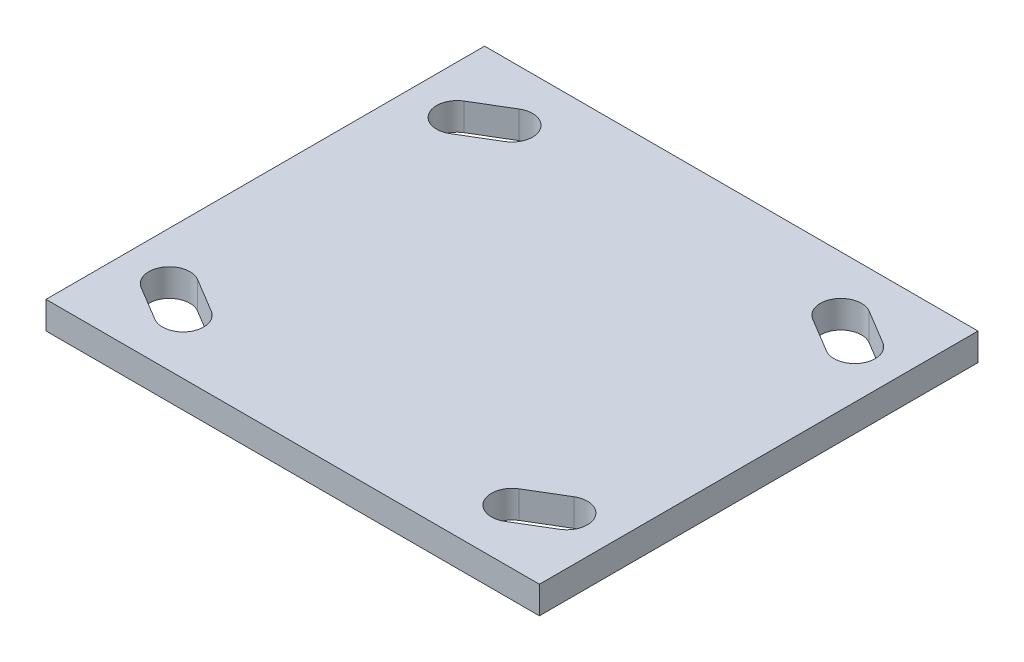
ISO-10303-21;
HEADER;
FILE_DESCRIPTION(('STEP AP214'),'2;1');
FILE_NAME('part.step','',(''),(''),'','','');
FILE_SCHEMA(('AUTOMOTIVE_DESIGN { 1 0 10303 214 1 1 1 1 }'));
ENDSEC;
DATA;
#1=APPLICATION_CONTEXT('core data for automotive mechanical design processes');
#2=APPLICATION_PROTOCOL_DEFINITION('international standard','automotive_design',2000,#1);
#3=PRODUCT_CONTEXT('',#1,'mechanical');
#4=PRODUCT('Part','Part','',(#3));
#5=PRODUCT_RELATED_PRODUCT_CATEGORY('part','',(#4));
#6=PRODUCT_DEFINITION_FORMATION('','',#4);
#7=PRODUCT_DEFINITION_CONTEXT('part definition',#1,'design');
#8=PRODUCT_DEFINITION('design','',#6,#7);
#9=PRODUCT_DEFINITION_SHAPE('','',#8);
#10=(LENGTH_UNIT() NAMED_UNIT(*) SI_UNIT(.MILLI.,.METRE.));
#11=(NAMED_UNIT(*) PLANE_ANGLE_UNIT() SI_UNIT($,.RADIAN.));
#12=(NAMED_UNIT(*) SI_UNIT($,.STERADIAN.) SOLID_ANGLE_UNIT());
#13=UNCERTAINTY_MEASURE_WITH_UNIT(LENGTH_MEASURE(1.E-05),#10,'distance_accuracy_value','');
#14=(GEOMETRIC_REPRESENTATION_CONTEXT(3) GLOBAL_UNCERTAINTY_ASSIGNED_CONTEXT((#13)) GLOBAL_UNIT_ASSIGNED_CONTEXT((#10,
#11,#12)) REPRESENTATION_CONTEXT('',''));
#15=CARTESIAN_POINT('',(0.,0.,0.));
#16=DIRECTION('',(0.,0.,1.));
#17=DIRECTION('',(1.,0.,0.));
#18=AXIS2_PLACEMENT_3D('',#15,#16,#17);
#19=CARTESIAN_POINT('',(-57.15,0.,50.8));
#20=DIRECTION('',(1.,0.,0.));
#21=DIRECTION('',(0.,0.,-1.));
#22=AXIS2_PLACEMENT_3D('',#19,#20,#21);
#23=PLANE('',#22);
#24=DIRECTION('',(0.,-1.,0.));
#25=VECTOR('',#24,1.);
#26=CARTESIAN_POINT('',(-57.15,0.,-50.8));
#27=LINE('',#26,#25);
#28=CARTESIAN_POINT('',(-57.15,0.,-50.8));
#29=VERTEX_POINT('',#28);
#30=CARTESIAN_POINT('',(-57.15,-6.35,-50.8));
#31=VERTEX_POINT('',#30);
#32=EDGE_CURVE('E300',#29,#31,#27,.T.);
#33=ORIENTED_EDGE('',*,*,#32,.T.);
#34=DIRECTION('',(0.,0.,-1.));
#35=VECTOR('',#34,1.);
#36=CARTESIAN_POINT('',(-57.15,-6.35,50.8));
#37=LINE('',#36,#35);
#38=CARTESIAN_POINT('',(-57.15,-6.35,50.8));
#39=VERTEX_POINT('',#38);
#40=EDGE_CURVE('E11',#39,#31,#37,.T.);
#41=ORIENTED_EDGE('',*,*,#40,.F.);
#42=DIRECTION('',(0.,-1.,0.));
#43=VECTOR('',#42,1.);
#44=CARTESIAN_POINT('',(-57.15,0.,50.8));
#45=LINE('',#44,#43);
#46=CARTESIAN_POINT('',(-57.15,0.,50.8));
#47=VERTEX_POINT('',#46);
#48=EDGE_CURVE('E307',#47,#39,#45,.T.);
#49=ORIENTED_EDGE('',*,*,#48,.F.);
#50=DIRECTION('',(0.,0.,-1.));
#51=VECTOR('',#50,1.);
#52=CARTESIAN_POINT('',(-57.15,0.,50.8));
#53=LINE('',#52,#51);
#54=EDGE_CURVE('E317',#47,#29,#53,.T.);
#55=ORIENTED_EDGE('',*,*,#54,.T.);
#56=EDGE_LOOP('',(#33,#41,#49,#55));
#57=FACE_BOUND('',#56,.T.);
#58=ADVANCED_FACE('F38',(#57),#23,.F.);
#59=CARTESIAN_POINT('',(-57.15,-6.35,50.8));
#60=DIRECTION('',(0.,1.,0.));
#61=DIRECTION('',(0.,0.,1.));
#62=AXIS2_PLACEMENT_3D('',#59,#60,#61);
#63=PLANE('',#62);
#64=DIRECTION('',(-0.857492925712546,0.,0.514495755427524));
#65=VECTOR('',#64,1.);
#66=CARTESIAN_POINT('',(35.6497139647764,-6.35,34.016189941294));
#67=LINE('',#66,#65);
#68=CARTESIAN_POINT('',(43.5872139647764,-6.35,29.253689941294));
#69=VERTEX_POINT('',#68);
#70=CARTESIAN_POINT('',(35.6497139647764,-6.35,34.016189941294));
#71=VERTEX_POINT('',#70);
#72=EDGE_CURVE('E182',#69,#71,#67,.T.);
#73=ORIENTED_EDGE('',*,*,#72,.T.);
#74=CARTESIAN_POINT('',(38.1,-6.35,38.1));
#75=DIRECTION('',(0.,1.,0.));
#76=DIRECTION('',(0.,0.,1.));
#77=AXIS2_PLACEMENT_3D('',#74,#75,#76);
#78=CIRCLE('',#77,4.76250000000001);
#79=CARTESIAN_POINT('',(40.5502860352236,-6.35,42.183810058706));
#80=VERTEX_POINT('',#79);
#81=EDGE_CURVE('E176',#71,#80,#78,.T.);
#82=ORIENTED_EDGE('',*,*,#81,.T.);
#83=DIRECTION('',(0.857492925712543,0.,-0.514495755427529));
#84=VECTOR('',#83,1.);
#85=CARTESIAN_POINT('',(40.5502860352236,-6.35,42.183810058706));
#86=LINE('',#85,#84);
#87=CARTESIAN_POINT('',(48.4877860352236,-6.35,37.421310058706));
#88=VERTEX_POINT('',#87);
#89=EDGE_CURVE('E185',#80,#88,#86,.T.);
#90=ORIENTED_EDGE('',*,*,#89,.T.);
#91=CARTESIAN_POINT('',(46.0375,-6.35,33.3375));
#92=DIRECTION('',(0.,1.,0.));
#93=DIRECTION('',(0.,0.,1.));
#94=AXIS2_PLACEMENT_3D('',#91,#92,#93);
#95=CIRCLE('',#94,4.76249999999998);
#96=EDGE_CURVE('E52',#88,#69,#95,.T.);
#97=ORIENTED_EDGE('',*,*,#96,.T.);
#98=EDGE_LOOP('',(#73,#82,#90,#97));
#99=FACE_BOUND('',#98,.T.);
#100=DIRECTION('',(-0.857492925712543,0.,-0.514495755427529));
#101=VECTOR('',#100,1.);
#102=CARTESIAN_POINT('',(40.5502860352236,-6.35,-42.183810058706));
#103=LINE('',#102,#101);
#104=CARTESIAN_POINT('',(48.4877860352236,-6.35,-37.421310058706));
#105=VERTEX_POINT('',#104);
#106=CARTESIAN_POINT('',(40.5502860352236,-6.35,-42.183810058706));
#107=VERTEX_POINT('',#106);
#108=EDGE_CURVE('E221',#105,#107,#103,.T.);
#109=ORIENTED_EDGE('',*,*,#108,.T.);
#110=CARTESIAN_POINT('',(38.1,-6.35,-38.1));
#111=DIRECTION('',(0.,1.,0.));
#112=DIRECTION('',(0.,0.,-1.));
#113=AXIS2_PLACEMENT_3D('',#110,#111,#112);
#114=CIRCLE('',#113,4.76250000000001);
#115=CARTESIAN_POINT('',(35.6497139647764,-6.35,-34.016189941294));
#116=VERTEX_POINT('',#115);
#117=EDGE_CURVE('E211',#107,#116,#114,.T.);
#118=ORIENTED_EDGE('',*,*,#117,.T.);
#119=DIRECTION('',(0.857492925712546,0.,0.514495755427524));
#120=VECTOR('',#119,1.);
#121=CARTESIAN_POINT('',(35.6497139647764,-6.35,-34.016189941294));
#122=LINE('',#121,#120);
#123=CARTESIAN_POINT('',(43.5872139647764,-6.35,-29.253689941294));
#124=VERTEX_POINT('',#123);
#125=EDGE_CURVE('E214',#116,#124,#122,.T.);
#126=ORIENTED_EDGE('',*,*,#125,.T.);
#127=CARTESIAN_POINT('',(46.0375,-6.35,-33.3375));
#128=DIRECTION('',(0.,1.,0.));
#129=DIRECTION('',(0.,0.,-1.));
#130=AXIS2_PLACEMENT_3D('',#127,#128,#129);
#131=CIRCLE('',#130,4.76249999999998);
#132=EDGE_CURVE('E218',#124,#105,#131,.T.);
#133=ORIENTED_EDGE('',*,*,#132,.T.);
#134=EDGE_LOOP('',(#109,#118,#126,#133));
#135=FACE_BOUND('',#134,.T.);
#136=DIRECTION('',(0.857492925712543,0.,0.514495755427529));
#137=VECTOR('',#136,1.);
#138=CARTESIAN_POINT('',(-40.5502860352236,-6.35,42.183810058706));
#139=LINE('',#138,#137);
#140=CARTESIAN_POINT('',(-48.4877860352236,-6.35,37.421310058706));
#141=VERTEX_POINT('',#140);
#142=CARTESIAN_POINT('',(-40.5502860352236,-6.35,42.183810058706));
#143=VERTEX_POINT('',#142);
#144=EDGE_CURVE('E253',#141,#143,#139,.T.);
#145=ORIENTED_EDGE('',*,*,#144,.T.);
#146=CARTESIAN_POINT('',(-38.1,-6.35,38.1));
#147=DIRECTION('',(0.,1.,0.));
#148=DIRECTION('',(0.,0.,-1.));
#149=AXIS2_PLACEMENT_3D('',#146,#147,#148);
#150=CIRCLE('',#149,4.76250000000001);
#151=CARTESIAN_POINT('',(-35.6497139647764,-6.35,34.016189941294));
#152=VERTEX_POINT('',#151);
#153=EDGE_CURVE('E243',#143,#152,#150,.T.);
#154=ORIENTED_EDGE('',*,*,#153,.T.);
#155=DIRECTION('',(-0.857492925712546,0.,-0.514495755427524));
#156=VECTOR('',#155,1.);
#157=CARTESIAN_POINT('',(-35.6497139647764,-6.35,34.016189941294));
#158=LINE('',#157,#156);
#159=CARTESIAN_POINT('',(-43.5872139647764,-6.35,29.253689941294));
#160=VERTEX_POINT('',#159);
#161=EDGE_CURVE('E246',#152,#160,#158,.T.);
#162=ORIENTED_EDGE('',*,*,#161,.T.);
#163=CARTESIAN_POINT('',(-46.0375,-6.35,33.3375));
#164=DIRECTION('',(0.,1.,0.));
#165=DIRECTION('',(0.,0.,-1.));
#166=AXIS2_PLACEMENT_3D('',#163,#164,#165);
#167=CIRCLE('',#166,4.76249999999998);
#168=EDGE_CURVE('E250',#160,#141,#167,.T.);
#169=ORIENTED_EDGE('',*,*,#168,.T.);
#170=EDGE_LOOP('',(#145,#154,#162,#169));
#171=FACE_BOUND('',#170,.T.);
#172=DIRECTION('',(0.857492925712546,0.,-0.514495755427524));
#173=VECTOR('',#172,1.);
#174=CARTESIAN_POINT('',(-35.6497139647764,-6.35,-34.016189941294));
#175=LINE('',#174,#173);
#176=CARTESIAN_POINT('',(-43.5872139647764,-6.35,-29.253689941294));
#177=VERTEX_POINT('',#176);
#178=CARTESIAN_POINT('',(-35.6497139647764,-6.35,-34.016189941294));
#179=VERTEX_POINT('',#178);
#180=EDGE_CURVE('E285',#177,#179,#175,.T.);
#181=ORIENTED_EDGE('',*,*,#180,.T.);
#182=CARTESIAN_POINT('',(-38.1,-6.35,-38.1));
#183=DIRECTION('',(0.,1.,0.));
#184=DIRECTION('',(0.,0.,1.));
#185=AXIS2_PLACEMENT_3D('',#182,#183,#184);
#186=CIRCLE('',#185,4.76250000000001);
#187=CARTESIAN_POINT('',(-40.5502860352236,-6.35,-42.183810058706));
#188=VERTEX_POINT('',#187);
#189=EDGE_CURVE('E275',#179,#188,#186,.T.);
#190=ORIENTED_EDGE('',*,*,#189,.T.);
#191=DIRECTION('',(-0.857492925712543,0.,0.514495755427529));
#192=VECTOR('',#191,1.);
#193=CARTESIAN_POINT('',(-40.5502860352236,-6.35,-42.183810058706));
#194=LINE('',#193,#192);
#195=CARTESIAN_POINT('',(-48.4877860352236,-6.35,-37.421310058706));
#196=VERTEX_POINT('',#195);
#197=EDGE_CURVE('E278',#188,#196,#194,.T.);
#198=ORIENTED_EDGE('',*,*,#197,.T.);
#199=CARTESIAN_POINT('',(-46.0375,-6.35,-33.3375));
#200=DIRECTION('',(0.,1.,0.));
#201=DIRECTION('',(0.,0.,1.));
#202=AXIS2_PLACEMENT_3D('',#199,#200,#201);
#203=CIRCLE('',#202,4.76249999999998);
#204=EDGE_CURVE('E282',#196,#177,#203,.T.);
#205=ORIENTED_EDGE('',*,*,#204,.T.);
#206=EDGE_LOOP('',(#181,#190,#198,#205));
#207=FACE_BOUND('',#206,.T.);
#208=DIRECTION('',(1.,0.,0.));
#209=VECTOR('',#208,1.);
#210=CARTESIAN_POINT('',(-57.15,-6.35,-50.8));
#211=LINE('',#210,#209);
#212=CARTESIAN_POINT('',(57.15,-6.35,-50.8));
#213=VERTEX_POINT('',#212);
#214=EDGE_CURVE('E320',#31,#213,#211,.T.);
#215=ORIENTED_EDGE('',*,*,#214,.T.);
#216=DIRECTION('',(0.,0.,-1.));
#217=VECTOR('',#216,1.);
#218=CARTESIAN_POINT('',(57.15,-6.35,50.8));
#219=LINE('',#218,#217);
#220=CARTESIAN_POINT('',(57.15,-6.35,50.8));
#221=VERTEX_POINT('',#220);
#222=EDGE_CURVE('E45',#221,#213,#219,.T.);
#223=ORIENTED_EDGE('',*,*,#222,.F.);
#224=DIRECTION('',(1.,0.,0.));
#225=VECTOR('',#224,1.);
#226=CARTESIAN_POINT('',(-57.15,-6.35,50.8));
#227=LINE('',#226,#225);
#228=EDGE_CURVE('E310',#39,#221,#227,.T.);
#229=ORIENTED_EDGE('',*,*,#228,.F.);
#230=ORIENTED_EDGE('',*,*,#40,.T.);
#231=EDGE_LOOP('',(#215,#223,#229,#230));
#232=FACE_BOUND('',#231,.T.);
#233=ADVANCED_FACE('F189',(#99,#135,#171,#207,#232),#63,.F.);
#234=CARTESIAN_POINT('',(57.15,0.,50.8));
#235=DIRECTION('',(-1.,0.,0.));
#236=DIRECTION('',(0.,0.,1.));
#237=AXIS2_PLACEMENT_3D('',#234,#235,#236);
#238=PLANE('',#237);
#239=DIRECTION('',(0.,1.,0.));
#240=VECTOR('',#239,1.);
#241=CARTESIAN_POINT('',(57.15,0.,-50.8));
#242=LINE('',#241,#240);
#243=CARTESIAN_POINT('',(57.15,0.,-50.8));
#244=VERTEX_POINT('',#243);
#245=EDGE_CURVE('E322',#213,#244,#242,.T.);
#246=ORIENTED_EDGE('',*,*,#245,.T.);
#247=DIRECTION('',(0.,0.,-1.));
#248=VECTOR('',#247,1.);
#249=CARTESIAN_POINT('',(57.15,0.,50.8));
#250=LINE('',#249,#248);
#251=CARTESIAN_POINT('',(57.15,0.,50.8));
#252=VERTEX_POINT('',#251);
#253=EDGE_CURVE('E327',#252,#244,#250,.T.);
#254=ORIENTED_EDGE('',*,*,#253,.F.);
#255=DIRECTION('',(0.,1.,0.));
#256=VECTOR('',#255,1.);
#257=CARTESIAN_POINT('',(57.15,0.,50.8));
#258=LINE('',#257,#256);
#259=EDGE_CURVE('E313',#221,#252,#258,.T.);
#260=ORIENTED_EDGE('',*,*,#259,.F.);
#261=ORIENTED_EDGE('',*,*,#222,.T.);
#262=EDGE_LOOP('',(#246,#254,#260,#261));
#263=FACE_BOUND('',#262,.T.);
#264=ADVANCED_FACE('F334',(#263),#238,.F.);
#265=CARTESIAN_POINT('',(-57.15,0.,50.8));
#266=DIRECTION('',(0.,-1.,0.));
#267=DIRECTION('',(0.,0.,-1.));
#268=AXIS2_PLACEMENT_3D('',#265,#266,#267);
#269=PLANE('',#268);
#270=DIRECTION('',(0.857492925712543,0.,-0.514495755427529));
#271=VECTOR('',#270,1.);
#272=CARTESIAN_POINT('',(40.5502860352236,0.,42.183810058706));
#273=LINE('',#272,#271);
#274=CARTESIAN_POINT('',(40.5502860352236,0.,42.183810058706));
#275=VERTEX_POINT('',#274);
#276=CARTESIAN_POINT('',(48.4877860352236,0.,37.421310058706));
#277=VERTEX_POINT('',#276);
#278=EDGE_CURVE('E201',#275,#277,#273,.T.);
#279=ORIENTED_EDGE('',*,*,#278,.F.);
#280=CARTESIAN_POINT('',(38.1,0.,38.1));
#281=DIRECTION('',(0.,1.,0.));
#282=DIRECTION('',(0.,0.,1.));
#283=AXIS2_PLACEMENT_3D('',#280,#281,#282);
#284=CIRCLE('',#283,4.76250000000001);
#285=CARTESIAN_POINT('',(35.6497139647764,0.,34.016189941294));
#286=VERTEX_POINT('',#285);
#287=EDGE_CURVE('E60',#286,#275,#284,.T.);
#288=ORIENTED_EDGE('',*,*,#287,.F.);
#289=DIRECTION('',(-0.857492925712546,0.,0.514495755427524));
#290=VECTOR('',#289,1.);
#291=CARTESIAN_POINT('',(35.6497139647764,0.,34.016189941294));
#292=LINE('',#291,#290);
#293=CARTESIAN_POINT('',(43.5872139647764,0.,29.253689941294));
#294=VERTEX_POINT('',#293);
#295=EDGE_CURVE('E192',#294,#286,#292,.T.);
#296=ORIENTED_EDGE('',*,*,#295,.F.);
#297=CARTESIAN_POINT('',(46.0375,0.,33.3375));
#298=DIRECTION('',(0.,1.,0.));
#299=DIRECTION('',(0.,0.,1.));
#300=AXIS2_PLACEMENT_3D('',#297,#298,#299);
#301=CIRCLE('',#300,4.76249999999998);
#302=EDGE_CURVE('E195',#277,#294,#301,.T.);
#303=ORIENTED_EDGE('',*,*,#302,.F.);
#304=EDGE_LOOP('',(#279,#288,#296,#303));
#305=FACE_BOUND('',#304,.T.);
#306=DIRECTION('',(0.857492925712546,0.,0.514495755427524));
#307=VECTOR('',#306,1.);
#308=CARTESIAN_POINT('',(35.6497139647764,0.,-34.016189941294));
#309=LINE('',#308,#307);
#310=CARTESIAN_POINT('',(35.6497139647764,0.,-34.016189941294));
#311=VERTEX_POINT('',#310);
#312=CARTESIAN_POINT('',(43.5872139647764,0.,-29.253689941294));
#313=VERTEX_POINT('',#312);
#314=EDGE_CURVE('E226',#311,#313,#309,.T.);
#315=ORIENTED_EDGE('',*,*,#314,.F.);
#316=CARTESIAN_POINT('',(38.1,0.,-38.1));
#317=DIRECTION('',(0.,1.,0.));
#318=DIRECTION('',(0.,0.,-1.));
#319=AXIS2_PLACEMENT_3D('',#316,#317,#318);
#320=CIRCLE('',#319,4.76250000000001);
#321=CARTESIAN_POINT('',(40.5502860352236,0.,-42.183810058706));
#322=VERTEX_POINT('',#321);
#323=EDGE_CURVE('E207',#322,#311,#320,.T.);
#324=ORIENTED_EDGE('',*,*,#323,.F.);
#325=DIRECTION('',(-0.857492925712543,0.,-0.514495755427529));
#326=VECTOR('',#325,1.);
#327=CARTESIAN_POINT('',(40.5502860352236,0.,-42.183810058706));
#328=LINE('',#327,#326);
#329=CARTESIAN_POINT('',(48.4877860352236,0.,-37.421310058706));
#330=VERTEX_POINT('',#329);
#331=EDGE_CURVE('E215',#330,#322,#328,.T.);
#332=ORIENTED_EDGE('',*,*,#331,.F.);
#333=CARTESIAN_POINT('',(46.0375,0.,-33.3375));
#334=DIRECTION('',(0.,1.,0.));
#335=DIRECTION('',(0.,0.,-1.));
#336=AXIS2_PLACEMENT_3D('',#333,#334,#335);
#337=CIRCLE('',#336,4.76249999999998);
#338=EDGE_CURVE('E229',#313,#330,#337,.T.);
#339=ORIENTED_EDGE('',*,*,#338,.F.);
#340=EDGE_LOOP('',(#315,#324,#332,#339));
#341=FACE_BOUND('',#340,.T.);
#342=DIRECTION('',(-0.857492925712546,0.,-0.514495755427524));
#343=VECTOR('',#342,1.);
#344=CARTESIAN_POINT('',(-35.6497139647764,0.,34.016189941294));
#345=LINE('',#344,#343);
#346=CARTESIAN_POINT('',(-35.6497139647764,0.,34.016189941294));
#347=VERTEX_POINT('',#346);
#348=CARTESIAN_POINT('',(-43.5872139647764,0.,29.253689941294));
#349=VERTEX_POINT('',#348);
#350=EDGE_CURVE('E258',#347,#349,#345,.T.);
#351=ORIENTED_EDGE('',*,*,#350,.F.);
#352=CARTESIAN_POINT('',(-38.1,0.,38.1));
#353=DIRECTION('',(0.,1.,0.));
#354=DIRECTION('',(0.,0.,-1.));
#355=AXIS2_PLACEMENT_3D('',#352,#353,#354);
#356=CIRCLE('',#355,4.76250000000001);
#357=CARTESIAN_POINT('',(-40.5502860352236,0.,42.183810058706));
#358=VERTEX_POINT('',#357);
#359=EDGE_CURVE('E236',#358,#347,#356,.T.);
#360=ORIENTED_EDGE('',*,*,#359,.F.);
#361=DIRECTION('',(0.857492925712543,0.,0.514495755427529));
#362=VECTOR('',#361,1.);
#363=CARTESIAN_POINT('',(-40.5502860352236,0.,42.183810058706));
#364=LINE('',#363,#362);
#365=CARTESIAN_POINT('',(-48.4877860352236,0.,37.421310058706));
#366=VERTEX_POINT('',#365);
#367=EDGE_CURVE('E247',#366,#358,#364,.T.);
#368=ORIENTED_EDGE('',*,*,#367,.F.);
#369=CARTESIAN_POINT('',(-46.0375,0.,33.3375));
#370=DIRECTION('',(0.,1.,0.));
#371=DIRECTION('',(0.,0.,-1.));
#372=AXIS2_PLACEMENT_3D('',#369,#370,#371);
#373=CIRCLE('',#372,4.76249999999998);
#374=EDGE_CURVE('E261',#349,#366,#373,.T.);
#375=ORIENTED_EDGE('',*,*,#374,.F.);
#376=EDGE_LOOP('',(#351,#360,#368,#375));
#377=FACE_BOUND('',#376,.T.);
#378=DIRECTION('',(-0.857492925712543,0.,0.514495755427529));
#379=VECTOR('',#378,1.);
#380=CARTESIAN_POINT('',(-40.5502860352236,0.,-42.183810058706));
#381=LINE('',#380,#379);
#382=CARTESIAN_POINT('',(-40.5502860352236,0.,-42.183810058706));
#383=VERTEX_POINT('',#382);
#384=CARTESIAN_POINT('',(-48.4877860352236,0.,-37.421310058706));
#385=VERTEX_POINT('',#384);
#386=EDGE_CURVE('E290',#383,#385,#381,.T.);
#387=ORIENTED_EDGE('',*,*,#386,.F.);
#388=CARTESIAN_POINT('',(-38.1,0.,-38.1));
#389=DIRECTION('',(0.,1.,0.));
#390=DIRECTION('',(0.,0.,1.));
#391=AXIS2_PLACEMENT_3D('',#388,#389,#390);
#392=CIRCLE('',#391,4.76250000000001);
#393=CARTESIAN_POINT('',(-35.6497139647764,0.,-34.016189941294));
#394=VERTEX_POINT('',#393);
#395=EDGE_CURVE('E268',#394,#383,#392,.T.);
#396=ORIENTED_EDGE('',*,*,#395,.F.);
#397=DIRECTION('',(0.857492925712546,0.,-0.514495755427524));
#398=VECTOR('',#397,1.);
#399=CARTESIAN_POINT('',(-35.6497139647764,0.,-34.016189941294));
#400=LINE('',#399,#398);
#401=CARTESIAN_POINT('',(-43.5872139647764,0.,-29.253689941294));
#402=VERTEX_POINT('',#401);
#403=EDGE_CURVE('E279',#402,#394,#400,.T.);
#404=ORIENTED_EDGE('',*,*,#403,.F.);
#405=CARTESIAN_POINT('',(-46.0375,0.,-33.3375));
#406=DIRECTION('',(0.,1.,0.));
#407=DIRECTION('',(0.,0.,1.));
#408=AXIS2_PLACEMENT_3D('',#405,#406,#407);
#409=CIRCLE('',#408,4.76249999999998);
#410=EDGE_CURVE('E293',#385,#402,#409,.T.);
#411=ORIENTED_EDGE('',*,*,#410,.F.);
#412=EDGE_LOOP('',(#387,#396,#404,#411));
#413=FACE_BOUND('',#412,.T.);
#414=DIRECTION('',(-1.,0.,0.));
#415=VECTOR('',#414,1.);
#416=CARTESIAN_POINT('',(-57.15,0.,-50.8));
#417=LINE('',#416,#415);
#418=EDGE_CURVE('E311',#244,#29,#417,.T.);
#419=ORIENTED_EDGE('',*,*,#418,.T.);
#420=ORIENTED_EDGE('',*,*,#54,.F.);
#421=DIRECTION('',(-1.,0.,0.));
#422=VECTOR('',#421,1.);
#423=CARTESIAN_POINT('',(-57.15,0.,50.8));
#424=LINE('',#423,#422);
#425=EDGE_CURVE('E315',#252,#47,#424,.T.);
#426=ORIENTED_EDGE('',*,*,#425,.F.);
#427=ORIENTED_EDGE('',*,*,#253,.T.);
#428=EDGE_LOOP('',(#419,#420,#426,#427));
#429=FACE_BOUND('',#428,.T.);
#430=ADVANCED_FACE('F343',(#305,#341,#377,#413,#429),#269,.F.);
#431=CARTESIAN_POINT('',(-57.15,-6.35,50.8));
#432=DIRECTION('',(0.,0.,1.));
#433=DIRECTION('',(1.,0.,0.));
#434=AXIS2_PLACEMENT_3D('',#431,#432,#433);
#435=PLANE('',#434);
#436=ORIENTED_EDGE('',*,*,#48,.T.);
#437=ORIENTED_EDGE('',*,*,#228,.T.);
#438=ORIENTED_EDGE('',*,*,#259,.T.);
#439=ORIENTED_EDGE('',*,*,#425,.T.);
#440=EDGE_LOOP('',(#436,#437,#438,#439));
#441=FACE_BOUND('',#440,.T.);
#442=ADVANCED_FACE('F349',(#441),#435,.T.);
#443=CARTESIAN_POINT('',(-57.15,-6.35,-50.8));
#444=DIRECTION('',(0.,0.,1.));
#445=DIRECTION('',(1.,0.,0.));
#446=AXIS2_PLACEMENT_3D('',#443,#444,#445);
#447=PLANE('',#446);
#448=ORIENTED_EDGE('',*,*,#32,.F.);
#449=ORIENTED_EDGE('',*,*,#418,.F.);
#450=ORIENTED_EDGE('',*,*,#245,.F.);
#451=ORIENTED_EDGE('',*,*,#214,.F.);
#452=EDGE_LOOP('',(#448,#449,#450,#451));
#453=FACE_BOUND('',#452,.T.);
#454=ADVANCED_FACE('F340',(#453),#447,.F.);
#455=CARTESIAN_POINT('',(-38.1,-6.35,-38.1));
#456=DIRECTION('',(0.,1.,0.));
#457=DIRECTION('',(0.,0.,1.));
#458=AXIS2_PLACEMENT_3D('',#455,#456,#457);
#459=CYLINDRICAL_SURFACE('',#458,4.76250000000001);
#460=ORIENTED_EDGE('',*,*,#395,.T.);
#461=DIRECTION('',(0.,1.,0.));
#462=VECTOR('',#461,1.);
#463=CARTESIAN_POINT('',(-40.5502860352236,-6.35,-42.183810058706));
#464=LINE('',#463,#462);
#465=EDGE_CURVE('E288',#188,#383,#464,.T.);
#466=ORIENTED_EDGE('',*,*,#465,.F.);
#467=ORIENTED_EDGE('',*,*,#189,.F.);
#468=DIRECTION('',(0.,1.,0.));
#469=VECTOR('',#468,1.);
#470=CARTESIAN_POINT('',(-35.6497139647764,-6.35,-34.016189941294));
#471=LINE('',#470,#469);
#472=EDGE_CURVE('E298',#179,#394,#471,.T.);
#473=ORIENTED_EDGE('',*,*,#472,.T.);
#474=EDGE_LOOP('',(#460,#466,#467,#473));
#475=FACE_BOUND('',#474,.T.);
#476=ADVANCED_FACE('F362',(#475),#459,.F.);
#477=CARTESIAN_POINT('',(-35.6497139647764,-6.35,-34.016189941294));
#478=DIRECTION('',(0.514495755427524,0.,0.857492925712546));
#479=DIRECTION('',(0.857492925712546,0.,-0.514495755427524));
#480=AXIS2_PLACEMENT_3D('',#477,#478,#479);
#481=PLANE('',#480);
#482=ORIENTED_EDGE('',*,*,#403,.T.);
#483=ORIENTED_EDGE('',*,*,#472,.F.);
#484=ORIENTED_EDGE('',*,*,#180,.F.);
#485=DIRECTION('',(0.,1.,0.));
#486=VECTOR('',#485,1.);
#487=CARTESIAN_POINT('',(-43.5872139647764,-6.35,-29.253689941294));
#488=LINE('',#487,#486);
#489=EDGE_CURVE('E301',#177,#402,#488,.T.);
#490=ORIENTED_EDGE('',*,*,#489,.T.);
#491=EDGE_LOOP('',(#482,#483,#484,#490));
#492=FACE_BOUND('',#491,.T.);
#493=ADVANCED_FACE('F367',(#492),#481,.F.);
#494=CARTESIAN_POINT('',(-46.0375,-6.35,-33.3375));
#495=DIRECTION('',(0.,1.,0.));
#496=DIRECTION('',(0.,0.,1.));
#497=AXIS2_PLACEMENT_3D('',#494,#495,#496);
#498=CYLINDRICAL_SURFACE('',#497,4.76249999999998);
#499=ORIENTED_EDGE('',*,*,#410,.T.);
#500=ORIENTED_EDGE('',*,*,#489,.F.);
#501=ORIENTED_EDGE('',*,*,#204,.F.);
#502=DIRECTION('',(0.,1.,0.));
#503=VECTOR('',#502,1.);
#504=CARTESIAN_POINT('',(-48.4877860352236,-6.35,-37.421310058706));
#505=LINE('',#504,#503);
#506=EDGE_CURVE('E303',#196,#385,#505,.T.);
#507=ORIENTED_EDGE('',*,*,#506,.T.);
#508=EDGE_LOOP('',(#499,#500,#501,#507));
#509=FACE_BOUND('',#508,.T.);
#510=ADVANCED_FACE('F373',(#509),#498,.F.);
#511=CARTESIAN_POINT('',(-40.5502860352236,-6.35,-42.183810058706));
#512=DIRECTION('',(-0.514495755427529,0.,-0.857492925712543));
#513=DIRECTION('',(-0.857492925712543,0.,0.514495755427529));
#514=AXIS2_PLACEMENT_3D('',#511,#512,#513);
#515=PLANE('',#514);
#516=ORIENTED_EDGE('',*,*,#386,.T.);
#517=ORIENTED_EDGE('',*,*,#506,.F.);
#518=ORIENTED_EDGE('',*,*,#197,.F.);
#519=ORIENTED_EDGE('',*,*,#465,.T.);
#520=EDGE_LOOP('',(#516,#517,#518,#519));
#521=FACE_BOUND('',#520,.T.);
#522=ADVANCED_FACE('F369',(#521),#515,.F.);
#523=CARTESIAN_POINT('',(-38.1,-6.35,38.1));
#524=DIRECTION('',(0.,1.,0.));
#525=DIRECTION('',(0.,0.,1.));
#526=AXIS2_PLACEMENT_3D('',#523,#524,#525);
#527=CYLINDRICAL_SURFACE('',#526,4.76250000000001);
#528=ORIENTED_EDGE('',*,*,#359,.T.);
#529=DIRECTION('',(0.,1.,0.));
#530=VECTOR('',#529,1.);
#531=CARTESIAN_POINT('',(-35.6497139647764,-6.35,34.016189941294));
#532=LINE('',#531,#530);
#533=EDGE_CURVE('E256',#152,#347,#532,.T.);
#534=ORIENTED_EDGE('',*,*,#533,.F.);
#535=ORIENTED_EDGE('',*,*,#153,.F.);
#536=DIRECTION('',(0.,1.,0.));
#537=VECTOR('',#536,1.);
#538=CARTESIAN_POINT('',(-40.5502860352236,-6.35,42.183810058706));
#539=LINE('',#538,#537);
#540=EDGE_CURVE('E266',#143,#358,#539,.T.);
#541=ORIENTED_EDGE('',*,*,#540,.T.);
#542=EDGE_LOOP('',(#528,#534,#535,#541));
#543=FACE_BOUND('',#542,.T.);
#544=ADVANCED_FACE('F372',(#543),#527,.F.);
#545=CARTESIAN_POINT('',(-40.5502860352236,-6.35,42.183810058706));
#546=DIRECTION('',(-0.514495755427529,0.,0.857492925712543));
#547=DIRECTION('',(0.857492925712543,0.,0.514495755427529));
#548=AXIS2_PLACEMENT_3D('',#545,#546,#547);
#549=PLANE('',#548);
#550=ORIENTED_EDGE('',*,*,#367,.T.);
#551=ORIENTED_EDGE('',*,*,#540,.F.);
#552=ORIENTED_EDGE('',*,*,#144,.F.);
#553=DIRECTION('',(0.,1.,0.));
#554=VECTOR('',#553,1.);
#555=CARTESIAN_POINT('',(-48.4877860352236,-6.35,37.421310058706));
#556=LINE('',#555,#554);
#557=EDGE_CURVE('E269',#141,#366,#556,.T.);
#558=ORIENTED_EDGE('',*,*,#557,.T.);
#559=EDGE_LOOP('',(#550,#551,#552,#558));
#560=FACE_BOUND('',#559,.T.);
#561=ADVANCED_FACE('F383',(#560),#549,.F.);
#562=CARTESIAN_POINT('',(-46.0375,-6.35,33.3375));
#563=DIRECTION('',(0.,1.,0.));
#564=DIRECTION('',(0.,0.,1.));
#565=AXIS2_PLACEMENT_3D('',#562,#563,#564);
#566=CYLINDRICAL_SURFACE('',#565,4.76249999999998);
#567=ORIENTED_EDGE('',*,*,#374,.T.);
#568=ORIENTED_EDGE('',*,*,#557,.F.);
#569=ORIENTED_EDGE('',*,*,#168,.F.);
#570=DIRECTION('',(0.,1.,0.));
#571=VECTOR('',#570,1.);
#572=CARTESIAN_POINT('',(-43.5872139647764,-6.35,29.253689941294));
#573=LINE('',#572,#571);
#574=EDGE_CURVE('E271',#160,#349,#573,.T.);
#575=ORIENTED_EDGE('',*,*,#574,.T.);
#576=EDGE_LOOP('',(#567,#568,#569,#575));
#577=FACE_BOUND('',#576,.T.);
#578=ADVANCED_FACE('F389',(#577),#566,.F.);
#579=CARTESIAN_POINT('',(-35.6497139647764,-6.35,34.016189941294));
#580=DIRECTION('',(0.514495755427524,0.,-0.857492925712546));
#581=DIRECTION('',(-0.857492925712546,0.,-0.514495755427524));
#582=AXIS2_PLACEMENT_3D('',#579,#580,#581);
#583=PLANE('',#582);
#584=ORIENTED_EDGE('',*,*,#350,.T.);
#585=ORIENTED_EDGE('',*,*,#574,.F.);
#586=ORIENTED_EDGE('',*,*,#161,.F.);
#587=ORIENTED_EDGE('',*,*,#533,.T.);
#588=EDGE_LOOP('',(#584,#585,#586,#587));
#589=FACE_BOUND('',#588,.T.);
#590=ADVANCED_FACE('F385',(#589),#583,.F.);
#591=CARTESIAN_POINT('',(38.1,-6.35,-38.1));
#592=DIRECTION('',(0.,1.,0.));
#593=DIRECTION('',(0.,0.,1.));
#594=AXIS2_PLACEMENT_3D('',#591,#592,#593);
#595=CYLINDRICAL_SURFACE('',#594,4.76250000000001);
#596=ORIENTED_EDGE('',*,*,#323,.T.);
#597=DIRECTION('',(0.,1.,0.));
#598=VECTOR('',#597,1.);
#599=CARTESIAN_POINT('',(35.6497139647764,-6.35,-34.016189941294));
#600=LINE('',#599,#598);
#601=EDGE_CURVE('E224',#116,#311,#600,.T.);
#602=ORIENTED_EDGE('',*,*,#601,.F.);
#603=ORIENTED_EDGE('',*,*,#117,.F.);
#604=DIRECTION('',(0.,1.,0.));
#605=VECTOR('',#604,1.);
#606=CARTESIAN_POINT('',(40.5502860352236,-6.35,-42.183810058706));
#607=LINE('',#606,#605);
#608=EDGE_CURVE('E234',#107,#322,#607,.T.);
#609=ORIENTED_EDGE('',*,*,#608,.T.);
#610=EDGE_LOOP('',(#596,#602,#603,#609));
#611=FACE_BOUND('',#610,.T.);
#612=ADVANCED_FACE('F388',(#611),#595,.F.);
#613=CARTESIAN_POINT('',(40.5502860352236,-6.35,-42.183810058706));
#614=DIRECTION('',(0.514495755427529,0.,-0.857492925712543));
#615=DIRECTION('',(-0.857492925712543,0.,-0.514495755427529));
#616=AXIS2_PLACEMENT_3D('',#613,#614,#615);
#617=PLANE('',#616);
#618=ORIENTED_EDGE('',*,*,#331,.T.);
#619=ORIENTED_EDGE('',*,*,#608,.F.);
#620=ORIENTED_EDGE('',*,*,#108,.F.);
#621=DIRECTION('',(0.,1.,0.));
#622=VECTOR('',#621,1.);
#623=CARTESIAN_POINT('',(48.4877860352236,-6.35,-37.421310058706));
#624=LINE('',#623,#622);
#625=EDGE_CURVE('E237',#105,#330,#624,.T.);
#626=ORIENTED_EDGE('',*,*,#625,.T.);
#627=EDGE_LOOP('',(#618,#619,#620,#626));
#628=FACE_BOUND('',#627,.T.);
#629=ADVANCED_FACE('F399',(#628),#617,.F.);
#630=CARTESIAN_POINT('',(46.0375,-6.35,-33.3375));
#631=DIRECTION('',(0.,1.,0.));
#632=DIRECTION('',(0.,0.,1.));
#633=AXIS2_PLACEMENT_3D('',#630,#631,#632);
#634=CYLINDRICAL_SURFACE('',#633,4.76249999999998);
#635=ORIENTED_EDGE('',*,*,#338,.T.);
#636=ORIENTED_EDGE('',*,*,#625,.F.);
#637=ORIENTED_EDGE('',*,*,#132,.F.);
#638=DIRECTION('',(0.,1.,0.));
#639=VECTOR('',#638,1.);
#640=CARTESIAN_POINT('',(43.5872139647764,-6.35,-29.253689941294));
#641=LINE('',#640,#639);
#642=EDGE_CURVE('E239',#124,#313,#641,.T.);
#643=ORIENTED_EDGE('',*,*,#642,.T.);
#644=EDGE_LOOP('',(#635,#636,#637,#643));
#645=FACE_BOUND('',#644,.T.);
#646=ADVANCED_FACE('F404',(#645),#634,.F.);
#647=CARTESIAN_POINT('',(35.6497139647764,-6.35,-34.016189941294));
#648=DIRECTION('',(-0.514495755427524,0.,0.857492925712546));
#649=DIRECTION('',(0.857492925712546,0.,0.514495755427524));
#650=AXIS2_PLACEMENT_3D('',#647,#648,#649);
#651=PLANE('',#650);
#652=ORIENTED_EDGE('',*,*,#314,.T.);
#653=ORIENTED_EDGE('',*,*,#642,.F.);
#654=ORIENTED_EDGE('',*,*,#125,.F.);
#655=ORIENTED_EDGE('',*,*,#601,.T.);
#656=EDGE_LOOP('',(#652,#653,#654,#655));
#657=FACE_BOUND('',#656,.T.);
#658=ADVANCED_FACE('F401',(#657),#651,.F.);
#659=CARTESIAN_POINT('',(38.1,-6.35,38.1));
#660=DIRECTION('',(0.,1.,0.));
#661=DIRECTION('',(0.,0.,1.));
#662=AXIS2_PLACEMENT_3D('',#659,#660,#661);
#663=CYLINDRICAL_SURFACE('',#662,4.76250000000001);
#664=ORIENTED_EDGE('',*,*,#287,.T.);
#665=DIRECTION('',(0.,1.,0.));
#666=VECTOR('',#665,1.);
#667=CARTESIAN_POINT('',(40.5502860352236,-6.35,42.183810058706));
#668=LINE('',#667,#666);
#669=EDGE_CURVE('E172',#80,#275,#668,.T.);
#670=ORIENTED_EDGE('',*,*,#669,.F.);
#671=ORIENTED_EDGE('',*,*,#81,.F.);
#672=DIRECTION('',(0.,1.,0.));
#673=VECTOR('',#672,1.);
#674=CARTESIAN_POINT('',(35.6497139647764,-6.35,34.016189941294));
#675=LINE('',#674,#673);
#676=EDGE_CURVE('E205',#71,#286,#675,.T.);
#677=ORIENTED_EDGE('',*,*,#676,.T.);
#678=EDGE_LOOP('',(#664,#670,#671,#677));
#679=FACE_BOUND('',#678,.T.);
#680=ADVANCED_FACE('F174',(#679),#663,.F.);
#681=CARTESIAN_POINT('',(35.6497139647764,-6.35,34.016189941294));
#682=DIRECTION('',(-0.514495755427524,0.,-0.857492925712546));
#683=DIRECTION('',(-0.857492925712546,0.,0.514495755427524));
#684=AXIS2_PLACEMENT_3D('',#681,#682,#683);
#685=PLANE('',#684);
#686=ORIENTED_EDGE('',*,*,#295,.T.);
#687=ORIENTED_EDGE('',*,*,#676,.F.);
#688=ORIENTED_EDGE('',*,*,#72,.F.);
#689=DIRECTION('',(0.,1.,0.));
#690=VECTOR('',#689,1.);
#691=CARTESIAN_POINT('',(43.5872139647764,-6.35,29.253689941294));
#692=LINE('',#691,#690);
#693=EDGE_CURVE('E208',#69,#294,#692,.T.);
#694=ORIENTED_EDGE('',*,*,#693,.T.);
#695=EDGE_LOOP('',(#686,#687,#688,#694));
#696=FACE_BOUND('',#695,.T.);
#697=ADVANCED_FACE('F414',(#696),#685,.F.);
#698=CARTESIAN_POINT('',(46.0375,-6.35,33.3375));
#699=DIRECTION('',(0.,1.,0.));
#700=DIRECTION('',(0.,0.,1.));
#701=AXIS2_PLACEMENT_3D('',#698,#699,#700);
#702=CYLINDRICAL_SURFACE('',#701,4.76249999999998);
#703=ORIENTED_EDGE('',*,*,#302,.T.);
#704=ORIENTED_EDGE('',*,*,#693,.F.);
#705=ORIENTED_EDGE('',*,*,#96,.F.);
#706=DIRECTION('',(0.,1.,0.));
#707=VECTOR('',#706,1.);
#708=CARTESIAN_POINT('',(48.4877860352236,-6.35,37.421310058706));
#709=LINE('',#708,#707);
#710=EDGE_CURVE('E181',#88,#277,#709,.T.);
#711=ORIENTED_EDGE('',*,*,#710,.T.);
#712=EDGE_LOOP('',(#703,#704,#705,#711));
#713=FACE_BOUND('',#712,.T.);
#714=ADVANCED_FACE('F417',(#713),#702,.F.);
#715=CARTESIAN_POINT('',(40.5502860352236,-6.35,42.183810058706));
#716=DIRECTION('',(0.514495755427529,0.,0.857492925712543));
#717=DIRECTION('',(0.857492925712543,0.,-0.514495755427529));
#718=AXIS2_PLACEMENT_3D('',#715,#716,#717);
#719=PLANE('',#718);
#720=ORIENTED_EDGE('',*,*,#278,.T.);
#721=ORIENTED_EDGE('',*,*,#710,.F.);
#722=ORIENTED_EDGE('',*,*,#89,.F.);
#723=ORIENTED_EDGE('',*,*,#669,.T.);
#724=EDGE_LOOP('',(#720,#721,#722,#723));
#725=FACE_BOUND('',#724,.T.);
#726=ADVANCED_FACE('F186',(#725),#719,.F.);
#727=CLOSED_SHELL('',(#58,#233,#264,#430,#442,#454,#476,#493,#510,#522,#544,#561,#578,#590,#612,
#629,#646,#658,#680,#697,#714,#726));
#728=MANIFOLD_SOLID_BREP('B2',#727);
#729=ADVANCED_BREP_SHAPE_REPRESENTATION('',(#18,#728),#14);
#730=SHAPE_DEFINITION_REPRESENTATION(#9,#729);
ENDSEC;
END-ISO-10303-21;
